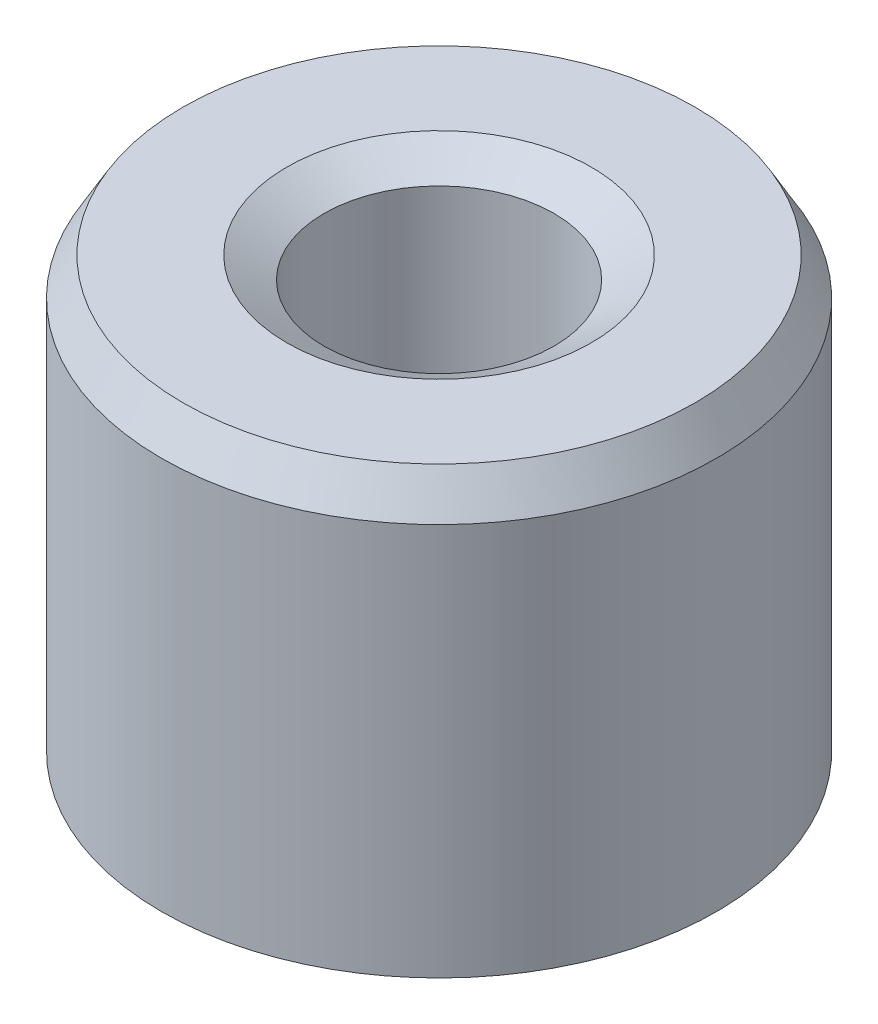
ISO-10303-21;
HEADER;
FILE_DESCRIPTION(('STEP AP214'),'2;1');
FILE_NAME('part.step','',(''),(''),'','','');
FILE_SCHEMA(('AUTOMOTIVE_DESIGN { 1 0 10303 214 1 1 1 1 }'));
ENDSEC;
DATA;
#1=APPLICATION_CONTEXT('core data for automotive mechanical design processes');
#2=APPLICATION_PROTOCOL_DEFINITION('international standard','automotive_design',2000,#1);
#3=PRODUCT_CONTEXT('',#1,'mechanical');
#4=PRODUCT('Part','Part','',(#3));
#5=PRODUCT_RELATED_PRODUCT_CATEGORY('part','',(#4));
#6=PRODUCT_DEFINITION_FORMATION('','',#4);
#7=PRODUCT_DEFINITION_CONTEXT('part definition',#1,'design');
#8=PRODUCT_DEFINITION('design','',#6,#7);
#9=PRODUCT_DEFINITION_SHAPE('','',#8);
#10=(LENGTH_UNIT() NAMED_UNIT(*) SI_UNIT(.MILLI.,.METRE.));
#11=(NAMED_UNIT(*) PLANE_ANGLE_UNIT() SI_UNIT($,.RADIAN.));
#12=(NAMED_UNIT(*) SI_UNIT($,.STERADIAN.) SOLID_ANGLE_UNIT());
#13=UNCERTAINTY_MEASURE_WITH_UNIT(LENGTH_MEASURE(1.E-05),#10,'distance_accuracy_value','');
#14=(GEOMETRIC_REPRESENTATION_CONTEXT(3) GLOBAL_UNCERTAINTY_ASSIGNED_CONTEXT((#13)) GLOBAL_UNIT_ASSIGNED_CONTEXT((#10,
#11,#12)) REPRESENTATION_CONTEXT('',''));
#15=CARTESIAN_POINT('',(0.,0.,0.));
#16=DIRECTION('',(0.,0.,1.));
#17=DIRECTION('',(1.,0.,0.));
#18=AXIS2_PLACEMENT_3D('',#15,#16,#17);
#19=CARTESIAN_POINT('',(0.,40.6519124954978,0.));
#20=DIRECTION('',(0.,-1.,0.));
#21=DIRECTION('',(0.,0.,-1.));
#22=AXIS2_PLACEMENT_3D('',#19,#20,#21);
#23=CYLINDRICAL_SURFACE('',#22,25.);
#24=CARTESIAN_POINT('',(0.,1.93795183693732,0.));
#25=DIRECTION('',(0.,1.,0.));
#26=DIRECTION('',(0.,0.,1.));
#27=AXIS2_PLACEMENT_3D('',#24,#25,#26);
#28=CIRCLE('',#27,25.);
#29=CARTESIAN_POINT('',(0.,1.93795183693732,25.));
#30=VERTEX_POINT('',#29);
#31=EDGE_CURVE('E10',#30,#30,#28,.T.);
#32=ORIENTED_EDGE('',*,*,#31,.T.);
#33=EDGE_LOOP('',(#32));
#34=FACE_BOUND('',#33,.T.);
#35=CARTESIAN_POINT('',(0.,37.2952814513009,0.));
#36=DIRECTION('',(0.,1.,0.));
#37=DIRECTION('',(0.,0.,1.));
#38=AXIS2_PLACEMENT_3D('',#35,#36,#37);
#39=CIRCLE('',#38,25.);
#40=CARTESIAN_POINT('',(0.,37.2952814513009,25.));
#41=VERTEX_POINT('',#40);
#42=EDGE_CURVE('E50',#41,#41,#39,.F.);
#43=ORIENTED_EDGE('',*,*,#42,.T.);
#44=EDGE_LOOP('',(#43));
#45=FACE_BOUND('',#44,.T.);
#46=ADVANCED_FACE('F39',(#34,#45),#23,.T.);
#47=CARTESIAN_POINT('',(0.,40.6519124954978,0.));
#48=DIRECTION('',(0.,1.,0.));
#49=DIRECTION('',(0.,0.,1.));
#50=AXIS2_PLACEMENT_3D('',#47,#48,#49);
#51=PLANE('',#50);
#52=CARTESIAN_POINT('',(0.,40.6519124954978,0.));
#53=DIRECTION('',(0.,1.,0.));
#54=DIRECTION('',(0.,0.,1.));
#55=AXIS2_PLACEMENT_3D('',#52,#53,#54);
#56=CIRCLE('',#55,13.7123248758668);
#57=CARTESIAN_POINT('',(0.,40.6519124954978,13.7123248758668));
#58=VERTEX_POINT('',#57);
#59=EDGE_CURVE('E58',#58,#58,#56,.F.);
#60=ORIENTED_EDGE('',*,*,#59,.T.);
#61=EDGE_LOOP('',(#60));
#62=FACE_BOUND('',#61,.T.);
#63=CARTESIAN_POINT('',(0.,40.6519124954978,0.));
#64=DIRECTION('',(0.,1.,0.));
#65=DIRECTION('',(0.,0.,1.));
#66=AXIS2_PLACEMENT_3D('',#63,#64,#65);
#67=CIRCLE('',#66,23.0620481630627);
#68=CARTESIAN_POINT('',(0.,40.6519124954978,23.0620481630627));
#69=VERTEX_POINT('',#68);
#70=EDGE_CURVE('E61',#69,#69,#67,.T.);
#71=ORIENTED_EDGE('',*,*,#70,.T.);
#72=EDGE_LOOP('',(#71));
#73=FACE_BOUND('',#72,.T.);
#74=ADVANCED_FACE('F88',(#62,#73),#51,.T.);
#75=CARTESIAN_POINT('',(0.,0.,0.));
#76=DIRECTION('',(0.,1.,0.));
#77=DIRECTION('',(0.,0.,1.));
#78=AXIS2_PLACEMENT_3D('',#75,#76,#77);
#79=PLANE('',#78);
#80=CARTESIAN_POINT('',(0.,0.,0.));
#81=DIRECTION('',(0.,1.,0.));
#82=DIRECTION('',(0.,0.,1.));
#83=AXIS2_PLACEMENT_3D('',#80,#81,#82);
#84=CIRCLE('',#83,12.2936456686072);
#85=CARTESIAN_POINT('',(0.,0.,12.2936456686072));
#86=VERTEX_POINT('',#85);
#87=EDGE_CURVE('E51',#86,#86,#84,.T.);
#88=ORIENTED_EDGE('',*,*,#87,.T.);
#89=EDGE_LOOP('',(#88));
#90=FACE_BOUND('',#89,.T.);
#91=CARTESIAN_POINT('',(0.,0.,0.));
#92=DIRECTION('',(0.,1.,0.));
#93=DIRECTION('',(0.,0.,1.));
#94=AXIS2_PLACEMENT_3D('',#91,#92,#93);
#95=CIRCLE('',#94,21.6433689558031);
#96=CARTESIAN_POINT('',(0.,0.,21.6433689558031));
#97=VERTEX_POINT('',#96);
#98=EDGE_CURVE('E54',#97,#97,#95,.F.);
#99=ORIENTED_EDGE('',*,*,#98,.T.);
#100=EDGE_LOOP('',(#99));
#101=FACE_BOUND('',#100,.T.);
#102=ADVANCED_FACE('F83',(#90,#101),#79,.F.);
#103=CARTESIAN_POINT('',(0.,40.6519124954978,0.));
#104=DIRECTION('',(0.,-1.,0.));
#105=DIRECTION('',(0.,0.,-1.));
#106=AXIS2_PLACEMENT_3D('',#103,#104,#105);
#107=CYLINDRICAL_SURFACE('',#106,10.3556938316699);
#108=CARTESIAN_POINT('',(0.,38.7139606585605,0.));
#109=DIRECTION('',(0.,1.,0.));
#110=DIRECTION('',(0.,0.,1.));
#111=AXIS2_PLACEMENT_3D('',#108,#109,#110);
#112=CIRCLE('',#111,10.3556938316699);
#113=CARTESIAN_POINT('',(0.,38.7139606585605,10.3556938316699));
#114=VERTEX_POINT('',#113);
#115=EDGE_CURVE('E67',#114,#114,#112,.T.);
#116=ORIENTED_EDGE('',*,*,#115,.T.);
#117=EDGE_LOOP('',(#116));
#118=FACE_BOUND('',#117,.T.);
#119=CARTESIAN_POINT('',(0.,3.35663104419691,0.));
#120=DIRECTION('',(0.,1.,0.));
#121=DIRECTION('',(0.,0.,1.));
#122=AXIS2_PLACEMENT_3D('',#119,#120,#121);
#123=CIRCLE('',#122,10.3556938316699);
#124=CARTESIAN_POINT('',(0.,3.35663104419691,10.3556938316699));
#125=VERTEX_POINT('',#124);
#126=EDGE_CURVE('E69',#125,#125,#123,.F.);
#127=ORIENTED_EDGE('',*,*,#126,.T.);
#128=EDGE_LOOP('',(#127));
#129=FACE_BOUND('',#128,.T.);
#130=ADVANCED_FACE('F71',(#118,#129),#107,.F.);
#131=CARTESIAN_POINT('',(0.,38.7139606585605,0.));
#132=DIRECTION('',(0.,1.,0.));
#133=DIRECTION('',(0.,0.,1.));
#134=AXIS2_PLACEMENT_3D('',#131,#132,#133);
#135=CONICAL_SURFACE('',#134,10.3556938316699,1.0471975511966);
#136=ORIENTED_EDGE('',*,*,#59,.F.);
#137=EDGE_LOOP('',(#136));
#138=FACE_BOUND('',#137,.T.);
#139=ORIENTED_EDGE('',*,*,#115,.F.);
#140=EDGE_LOOP('',(#139));
#141=FACE_BOUND('',#140,.T.);
#142=ADVANCED_FACE('F77',(#138,#141),#135,.F.);
#143=CARTESIAN_POINT('',(0.,0.,0.));
#144=DIRECTION('',(0.,-1.,0.));
#145=DIRECTION('',(0.,0.,-1.));
#146=AXIS2_PLACEMENT_3D('',#143,#144,#145);
#147=CONICAL_SURFACE('',#146,12.2936456686072,0.523598775598294);
#148=ORIENTED_EDGE('',*,*,#126,.F.);
#149=EDGE_LOOP('',(#148));
#150=FACE_BOUND('',#149,.T.);
#151=ORIENTED_EDGE('',*,*,#87,.F.);
#152=EDGE_LOOP('',(#151));
#153=FACE_BOUND('',#152,.T.);
#154=ADVANCED_FACE('F73',(#150,#153),#147,.F.);
#155=CARTESIAN_POINT('',(0.,1.93795183693732,0.));
#156=DIRECTION('',(0.,1.,0.));
#157=DIRECTION('',(0.,0.,1.));
#158=AXIS2_PLACEMENT_3D('',#155,#156,#157);
#159=CONICAL_SURFACE('',#158,25.,1.0471975511966);
#160=ORIENTED_EDGE('',*,*,#98,.F.);
#161=EDGE_LOOP('',(#160));
#162=FACE_BOUND('',#161,.T.);
#163=ORIENTED_EDGE('',*,*,#31,.F.);
#164=EDGE_LOOP('',(#163));
#165=FACE_BOUND('',#164,.T.);
#166=ADVANCED_FACE('F76',(#162,#165),#159,.T.);
#167=CARTESIAN_POINT('',(0.,40.6519124954978,0.));
#168=DIRECTION('',(0.,-1.,0.));
#169=DIRECTION('',(0.,0.,-1.));
#170=AXIS2_PLACEMENT_3D('',#167,#168,#169);
#171=CONICAL_SURFACE('',#170,23.0620481630627,0.523598775598297);
#172=ORIENTED_EDGE('',*,*,#42,.F.);
#173=EDGE_LOOP('',(#172));
#174=FACE_BOUND('',#173,.T.);
#175=ORIENTED_EDGE('',*,*,#70,.F.);
#176=EDGE_LOOP('',(#175));
#177=FACE_BOUND('',#176,.T.);
#178=ADVANCED_FACE('F45',(#174,#177),#171,.T.);
#179=CLOSED_SHELL('',(#46,#74,#102,#130,#142,#154,#166,#178));
#180=MANIFOLD_SOLID_BREP('B2',#179);
#181=ADVANCED_BREP_SHAPE_REPRESENTATION('',(#18,#180),#14);
#182=SHAPE_DEFINITION_REPRESENTATION(#9,#181);
ENDSEC;
END-ISO-10303-21;
